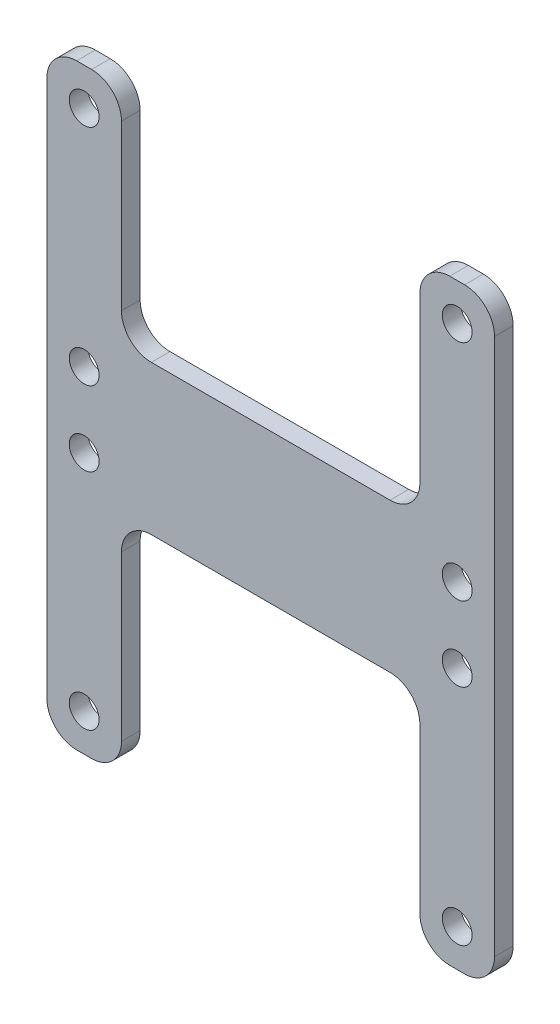
ISO-10303-21;
HEADER;
FILE_DESCRIPTION(('STEP AP214'),'2;1');
FILE_NAME('part.step','',(''),(''),'','','');
FILE_SCHEMA(('AUTOMOTIVE_DESIGN { 1 0 10303 214 1 1 1 1 }'));
ENDSEC;
DATA;
#1=APPLICATION_CONTEXT('core data for automotive mechanical design processes');
#2=APPLICATION_PROTOCOL_DEFINITION('international standard','automotive_design',2000,#1);
#3=PRODUCT_CONTEXT('',#1,'mechanical');
#4=PRODUCT('Part','Part','',(#3));
#5=PRODUCT_RELATED_PRODUCT_CATEGORY('part','',(#4));
#6=PRODUCT_DEFINITION_FORMATION('','',#4);
#7=PRODUCT_DEFINITION_CONTEXT('part definition',#1,'design');
#8=PRODUCT_DEFINITION('design','',#6,#7);
#9=PRODUCT_DEFINITION_SHAPE('','',#8);
#10=(LENGTH_UNIT() NAMED_UNIT(*) SI_UNIT(.MILLI.,.METRE.));
#11=(NAMED_UNIT(*) PLANE_ANGLE_UNIT() SI_UNIT($,.RADIAN.));
#12=(NAMED_UNIT(*) SI_UNIT($,.STERADIAN.) SOLID_ANGLE_UNIT());
#13=UNCERTAINTY_MEASURE_WITH_UNIT(LENGTH_MEASURE(1.E-05),#10,'distance_accuracy_value','');
#14=(GEOMETRIC_REPRESENTATION_CONTEXT(3) GLOBAL_UNCERTAINTY_ASSIGNED_CONTEXT((#13)) GLOBAL_UNIT_ASSIGNED_CONTEXT((#10,
#11,#12)) REPRESENTATION_CONTEXT('',''));
#15=CARTESIAN_POINT('',(0.,0.,0.));
#16=DIRECTION('',(0.,0.,1.));
#17=DIRECTION('',(1.,0.,0.));
#18=AXIS2_PLACEMENT_3D('',#15,#16,#17);
#19=CARTESIAN_POINT('',(0.,50.8,3.175));
#20=DIRECTION('',(0.,1.,0.));
#21=DIRECTION('',(0.,0.,1.));
#22=AXIS2_PLACEMENT_3D('',#19,#20,#21);
#23=PLANE('',#22);
#24=DIRECTION('',(1.,0.,0.));
#25=VECTOR('',#24,1.);
#26=CARTESIAN_POINT('',(0.,50.8,0.));
#27=LINE('',#26,#25);
#28=CARTESIAN_POINT('',(30.48,50.8,0.));
#29=VERTEX_POINT('',#28);
#30=CARTESIAN_POINT('',(33.02,50.8,0.));
#31=VERTEX_POINT('',#30);
#32=EDGE_CURVE('E400',#29,#31,#27,.T.);
#33=ORIENTED_EDGE('',*,*,#32,.F.);
#34=DIRECTION('',(0.,0.,-1.));
#35=VECTOR('',#34,1.);
#36=CARTESIAN_POINT('',(30.48,50.8,3.175));
#37=LINE('',#36,#35);
#38=CARTESIAN_POINT('',(30.48,50.8,3.175));
#39=VERTEX_POINT('',#38);
#40=EDGE_CURVE('E11',#29,#39,#37,.F.);
#41=ORIENTED_EDGE('',*,*,#40,.T.);
#42=DIRECTION('',(1.,0.,0.));
#43=VECTOR('',#42,1.);
#44=CARTESIAN_POINT('',(0.,50.8,3.175));
#45=LINE('',#44,#43);
#46=CARTESIAN_POINT('',(33.02,50.8,3.175));
#47=VERTEX_POINT('',#46);
#48=EDGE_CURVE('E256',#39,#47,#45,.T.);
#49=ORIENTED_EDGE('',*,*,#48,.T.);
#50=DIRECTION('',(0.,0.,-1.));
#51=VECTOR('',#50,1.);
#52=CARTESIAN_POINT('',(33.02,50.8,3.175));
#53=LINE('',#52,#51);
#54=EDGE_CURVE('E53',#47,#31,#53,.T.);
#55=ORIENTED_EDGE('',*,*,#54,.T.);
#56=EDGE_LOOP('',(#33,#41,#49,#55));
#57=FACE_BOUND('',#56,.T.);
#58=ADVANCED_FACE('F44',(#57),#23,.T.);
#59=CARTESIAN_POINT('',(25.4,0.,3.175));
#60=DIRECTION('',(-1.,0.,0.));
#61=DIRECTION('',(0.,0.,1.));
#62=AXIS2_PLACEMENT_3D('',#59,#60,#61);
#63=PLANE('',#62);
#64=DIRECTION('',(0.,1.,0.));
#65=VECTOR('',#64,1.);
#66=CARTESIAN_POINT('',(25.4,0.,3.175));
#67=LINE('',#66,#65);
#68=CARTESIAN_POINT('',(25.4,17.78,3.175));
#69=VERTEX_POINT('',#68);
#70=CARTESIAN_POINT('',(25.4,45.72,3.175));
#71=VERTEX_POINT('',#70);
#72=EDGE_CURVE('E553',#69,#71,#67,.T.);
#73=ORIENTED_EDGE('',*,*,#72,.T.);
#74=DIRECTION('',(0.,0.,-1.));
#75=VECTOR('',#74,1.);
#76=CARTESIAN_POINT('',(25.4,45.72,3.175));
#77=LINE('',#76,#75);
#78=CARTESIAN_POINT('',(25.4,45.72,0.));
#79=VERTEX_POINT('',#78);
#80=EDGE_CURVE('E390',#71,#79,#77,.T.);
#81=ORIENTED_EDGE('',*,*,#80,.T.);
#82=DIRECTION('',(0.,1.,0.));
#83=VECTOR('',#82,1.);
#84=CARTESIAN_POINT('',(25.4,0.,0.));
#85=LINE('',#84,#83);
#86=CARTESIAN_POINT('',(25.4,17.78,0.));
#87=VERTEX_POINT('',#86);
#88=EDGE_CURVE('E408',#87,#79,#85,.T.);
#89=ORIENTED_EDGE('',*,*,#88,.F.);
#90=DIRECTION('',(0.,0.,-1.));
#91=VECTOR('',#90,1.);
#92=CARTESIAN_POINT('',(25.4,17.78,3.175));
#93=LINE('',#92,#91);
#94=EDGE_CURVE('E273',#87,#69,#93,.F.);
#95=ORIENTED_EDGE('',*,*,#94,.T.);
#96=EDGE_LOOP('',(#73,#81,#89,#95));
#97=FACE_BOUND('',#96,.T.);
#98=ADVANCED_FACE('F503',(#97),#63,.T.);
#99=CARTESIAN_POINT('',(0.,12.7,3.175));
#100=DIRECTION('',(0.,1.,0.));
#101=DIRECTION('',(0.,0.,1.));
#102=AXIS2_PLACEMENT_3D('',#99,#100,#101);
#103=PLANE('',#102);
#104=DIRECTION('',(1.,0.,0.));
#105=VECTOR('',#104,1.);
#106=CARTESIAN_POINT('',(0.,12.7,3.175));
#107=LINE('',#106,#105);
#108=CARTESIAN_POINT('',(-20.32,12.7,3.175));
#109=VERTEX_POINT('',#108);
#110=CARTESIAN_POINT('',(20.32,12.7,3.175));
#111=VERTEX_POINT('',#110);
#112=EDGE_CURVE('E558',#109,#111,#107,.T.);
#113=ORIENTED_EDGE('',*,*,#112,.T.);
#114=DIRECTION('',(0.,0.,-1.));
#115=VECTOR('',#114,1.);
#116=CARTESIAN_POINT('',(20.32,12.7,0.));
#117=LINE('',#116,#115);
#118=CARTESIAN_POINT('',(20.32,12.7,0.));
#119=VERTEX_POINT('',#118);
#120=EDGE_CURVE('E269',#111,#119,#117,.T.);
#121=ORIENTED_EDGE('',*,*,#120,.T.);
#122=DIRECTION('',(1.,0.,0.));
#123=VECTOR('',#122,1.);
#124=CARTESIAN_POINT('',(0.,12.7,0.));
#125=LINE('',#124,#123);
#126=CARTESIAN_POINT('',(-20.32,12.7,0.));
#127=VERTEX_POINT('',#126);
#128=EDGE_CURVE('E413',#127,#119,#125,.T.);
#129=ORIENTED_EDGE('',*,*,#128,.F.);
#130=DIRECTION('',(0.,0.,-1.));
#131=VECTOR('',#130,1.);
#132=CARTESIAN_POINT('',(-20.32,12.7,3.175));
#133=LINE('',#132,#131);
#134=EDGE_CURVE('E266',#127,#109,#133,.F.);
#135=ORIENTED_EDGE('',*,*,#134,.T.);
#136=EDGE_LOOP('',(#113,#121,#129,#135));
#137=FACE_BOUND('',#136,.T.);
#138=ADVANCED_FACE('F508',(#137),#103,.T.);
#139=CARTESIAN_POINT('',(-25.4,0.,3.175));
#140=DIRECTION('',(1.,0.,0.));
#141=DIRECTION('',(0.,1.,0.));
#142=AXIS2_PLACEMENT_3D('',#139,#140,#141);
#143=PLANE('',#142);
#144=DIRECTION('',(0.,-1.,0.));
#145=VECTOR('',#144,1.);
#146=CARTESIAN_POINT('',(-25.4,0.,0.));
#147=LINE('',#146,#145);
#148=CARTESIAN_POINT('',(-25.4,45.72,0.));
#149=VERTEX_POINT('',#148);
#150=CARTESIAN_POINT('',(-25.4,17.78,0.));
#151=VERTEX_POINT('',#150);
#152=EDGE_CURVE('E424',#149,#151,#147,.T.);
#153=ORIENTED_EDGE('',*,*,#152,.F.);
#154=DIRECTION('',(0.,0.,-1.));
#155=VECTOR('',#154,1.);
#156=CARTESIAN_POINT('',(-25.4,45.72,3.175));
#157=LINE('',#156,#155);
#158=CARTESIAN_POINT('',(-25.4,45.72,3.175));
#159=VERTEX_POINT('',#158);
#160=EDGE_CURVE('E387',#149,#159,#157,.F.);
#161=ORIENTED_EDGE('',*,*,#160,.T.);
#162=DIRECTION('',(0.,-1.,0.));
#163=VECTOR('',#162,1.);
#164=CARTESIAN_POINT('',(-25.4,0.,3.175));
#165=LINE('',#164,#163);
#166=CARTESIAN_POINT('',(-25.4,17.78,3.175));
#167=VERTEX_POINT('',#166);
#168=EDGE_CURVE('E563',#159,#167,#165,.T.);
#169=ORIENTED_EDGE('',*,*,#168,.T.);
#170=DIRECTION('',(0.,0.,-1.));
#171=VECTOR('',#170,1.);
#172=CARTESIAN_POINT('',(-25.4,17.78,0.));
#173=LINE('',#172,#171);
#174=EDGE_CURVE('E221',#167,#151,#173,.T.);
#175=ORIENTED_EDGE('',*,*,#174,.T.);
#176=EDGE_LOOP('',(#153,#161,#169,#175));
#177=FACE_BOUND('',#176,.T.);
#178=ADVANCED_FACE('F594',(#177),#143,.T.);
#179=CARTESIAN_POINT('',(0.,50.8,3.175));
#180=DIRECTION('',(0.,1.,0.));
#181=DIRECTION('',(0.,0.,1.));
#182=AXIS2_PLACEMENT_3D('',#179,#180,#181);
#183=PLANE('',#182);
#184=DIRECTION('',(1.,0.,0.));
#185=VECTOR('',#184,1.);
#186=CARTESIAN_POINT('',(0.,50.8,0.));
#187=LINE('',#186,#185);
#188=CARTESIAN_POINT('',(-33.02,50.8,0.));
#189=VERTEX_POINT('',#188);
#190=CARTESIAN_POINT('',(-30.48,50.8,0.));
#191=VERTEX_POINT('',#190);
#192=EDGE_CURVE('E427',#189,#191,#187,.T.);
#193=ORIENTED_EDGE('',*,*,#192,.F.);
#194=DIRECTION('',(0.,0.,-1.));
#195=VECTOR('',#194,1.);
#196=CARTESIAN_POINT('',(-33.02,50.8,3.175));
#197=LINE('',#196,#195);
#198=CARTESIAN_POINT('',(-33.02,50.8,3.175));
#199=VERTEX_POINT('',#198);
#200=EDGE_CURVE('E384',#189,#199,#197,.F.);
#201=ORIENTED_EDGE('',*,*,#200,.T.);
#202=DIRECTION('',(1.,0.,0.));
#203=VECTOR('',#202,1.);
#204=CARTESIAN_POINT('',(0.,50.8,3.175));
#205=LINE('',#204,#203);
#206=CARTESIAN_POINT('',(-30.48,50.8,3.175));
#207=VERTEX_POINT('',#206);
#208=EDGE_CURVE('E570',#199,#207,#205,.T.);
#209=ORIENTED_EDGE('',*,*,#208,.T.);
#210=DIRECTION('',(0.,0.,-1.));
#211=VECTOR('',#210,1.);
#212=CARTESIAN_POINT('',(-30.48,50.8,3.175));
#213=LINE('',#212,#211);
#214=EDGE_CURVE('E380',#207,#191,#213,.T.);
#215=ORIENTED_EDGE('',*,*,#214,.T.);
#216=EDGE_LOOP('',(#193,#201,#209,#215));
#217=FACE_BOUND('',#216,.T.);
#218=ADVANCED_FACE('F587',(#217),#183,.T.);
#219=CARTESIAN_POINT('',(-38.1,0.,3.175));
#220=DIRECTION('',(1.,0.,0.));
#221=DIRECTION('',(0.,1.,0.));
#222=AXIS2_PLACEMENT_3D('',#219,#220,#221);
#223=PLANE('',#222);
#224=DIRECTION('',(0.,-1.,0.));
#225=VECTOR('',#224,1.);
#226=CARTESIAN_POINT('',(-38.1,0.,0.));
#227=LINE('',#226,#225);
#228=CARTESIAN_POINT('',(-38.1,45.72,0.));
#229=VERTEX_POINT('',#228);
#230=CARTESIAN_POINT('',(-38.1,-45.72,0.));
#231=VERTEX_POINT('',#230);
#232=EDGE_CURVE('E431',#229,#231,#227,.T.);
#233=ORIENTED_EDGE('',*,*,#232,.T.);
#234=DIRECTION('',(0.,0.,-1.));
#235=VECTOR('',#234,1.);
#236=CARTESIAN_POINT('',(-38.1,-45.72,3.175));
#237=LINE('',#236,#235);
#238=CARTESIAN_POINT('',(-38.1,-45.72,3.175));
#239=VERTEX_POINT('',#238);
#240=EDGE_CURVE('E377',#231,#239,#237,.F.);
#241=ORIENTED_EDGE('',*,*,#240,.T.);
#242=DIRECTION('',(0.,-1.,0.));
#243=VECTOR('',#242,1.);
#244=CARTESIAN_POINT('',(-38.1,0.,3.175));
#245=LINE('',#244,#243);
#246=CARTESIAN_POINT('',(-38.1,45.72,3.175));
#247=VERTEX_POINT('',#246);
#248=EDGE_CURVE('E455',#247,#239,#245,.T.);
#249=ORIENTED_EDGE('',*,*,#248,.F.);
#250=DIRECTION('',(0.,0.,-1.));
#251=VECTOR('',#250,1.);
#252=CARTESIAN_POINT('',(-38.1,45.72,0.));
#253=LINE('',#252,#251);
#254=EDGE_CURVE('E373',#247,#229,#253,.T.);
#255=ORIENTED_EDGE('',*,*,#254,.T.);
#256=EDGE_LOOP('',(#233,#241,#249,#255));
#257=FACE_BOUND('',#256,.T.);
#258=ADVANCED_FACE('F583',(#257),#223,.F.);
#259=CARTESIAN_POINT('',(0.,-50.8,3.175));
#260=DIRECTION('',(0.,1.,0.));
#261=DIRECTION('',(0.,0.,1.));
#262=AXIS2_PLACEMENT_3D('',#259,#260,#261);
#263=PLANE('',#262);
#264=DIRECTION('',(1.,0.,0.));
#265=VECTOR('',#264,1.);
#266=CARTESIAN_POINT('',(0.,-50.8,0.));
#267=LINE('',#266,#265);
#268=CARTESIAN_POINT('',(-33.02,-50.8,0.));
#269=VERTEX_POINT('',#268);
#270=CARTESIAN_POINT('',(-30.48,-50.8,0.));
#271=VERTEX_POINT('',#270);
#272=EDGE_CURVE('E246',#269,#271,#267,.T.);
#273=ORIENTED_EDGE('',*,*,#272,.T.);
#274=DIRECTION('',(0.,0.,-1.));
#275=VECTOR('',#274,1.);
#276=CARTESIAN_POINT('',(-30.48,-50.8,3.175));
#277=LINE('',#276,#275);
#278=CARTESIAN_POINT('',(-30.48,-50.8,3.175));
#279=VERTEX_POINT('',#278);
#280=EDGE_CURVE('E370',#271,#279,#277,.F.);
#281=ORIENTED_EDGE('',*,*,#280,.T.);
#282=DIRECTION('',(1.,0.,0.));
#283=VECTOR('',#282,1.);
#284=CARTESIAN_POINT('',(0.,-50.8,3.175));
#285=LINE('',#284,#283);
#286=CARTESIAN_POINT('',(-33.02,-50.8,3.175));
#287=VERTEX_POINT('',#286);
#288=EDGE_CURVE('E449',#287,#279,#285,.T.);
#289=ORIENTED_EDGE('',*,*,#288,.F.);
#290=DIRECTION('',(0.,0.,-1.));
#291=VECTOR('',#290,1.);
#292=CARTESIAN_POINT('',(-33.02,-50.8,3.175));
#293=LINE('',#292,#291);
#294=EDGE_CURVE('E366',#287,#269,#293,.T.);
#295=ORIENTED_EDGE('',*,*,#294,.T.);
#296=EDGE_LOOP('',(#273,#281,#289,#295));
#297=FACE_BOUND('',#296,.T.);
#298=ADVANCED_FACE('F439',(#297),#263,.F.);
#299=CARTESIAN_POINT('',(-25.4,0.,3.175));
#300=DIRECTION('',(-1.,0.,0.));
#301=DIRECTION('',(0.,0.,1.));
#302=AXIS2_PLACEMENT_3D('',#299,#300,#301);
#303=PLANE('',#302);
#304=DIRECTION('',(0.,1.,0.));
#305=VECTOR('',#304,1.);
#306=CARTESIAN_POINT('',(-25.4,0.,3.175));
#307=LINE('',#306,#305);
#308=CARTESIAN_POINT('',(-25.4,-45.72,3.175));
#309=VERTEX_POINT('',#308);
#310=CARTESIAN_POINT('',(-25.4,-17.7800000000001,3.175));
#311=VERTEX_POINT('',#310);
#312=EDGE_CURVE('E447',#309,#311,#307,.T.);
#313=ORIENTED_EDGE('',*,*,#312,.F.);
#314=DIRECTION('',(0.,0.,-1.));
#315=VECTOR('',#314,1.);
#316=CARTESIAN_POINT('',(-25.4,-45.72,3.175));
#317=LINE('',#316,#315);
#318=CARTESIAN_POINT('',(-25.4,-45.72,0.));
#319=VERTEX_POINT('',#318);
#320=EDGE_CURVE('E362',#309,#319,#317,.T.);
#321=ORIENTED_EDGE('',*,*,#320,.T.);
#322=DIRECTION('',(0.,1.,0.));
#323=VECTOR('',#322,1.);
#324=CARTESIAN_POINT('',(-25.4,0.,0.));
#325=LINE('',#324,#323);
#326=CARTESIAN_POINT('',(-25.4,-17.7800000000001,0.));
#327=VERTEX_POINT('',#326);
#328=EDGE_CURVE('E240',#319,#327,#325,.T.);
#329=ORIENTED_EDGE('',*,*,#328,.T.);
#330=DIRECTION('',(0.,0.,-1.));
#331=VECTOR('',#330,1.);
#332=CARTESIAN_POINT('',(-25.4,-17.7800000000001,3.175));
#333=LINE('',#332,#331);
#334=EDGE_CURVE('E215',#327,#311,#333,.F.);
#335=ORIENTED_EDGE('',*,*,#334,.T.);
#336=EDGE_LOOP('',(#313,#321,#329,#335));
#337=FACE_BOUND('',#336,.T.);
#338=ADVANCED_FACE('F446',(#337),#303,.F.);
#339=CARTESIAN_POINT('',(0.,-12.7000000000001,3.175));
#340=DIRECTION('',(0.,1.,0.));
#341=DIRECTION('',(0.,0.,1.));
#342=AXIS2_PLACEMENT_3D('',#339,#340,#341);
#343=PLANE('',#342);
#344=DIRECTION('',(1.,0.,0.));
#345=VECTOR('',#344,1.);
#346=CARTESIAN_POINT('',(0.,-12.7000000000001,3.175));
#347=LINE('',#346,#345);
#348=CARTESIAN_POINT('',(-20.32,-12.7000000000001,3.175));
#349=VERTEX_POINT('',#348);
#350=CARTESIAN_POINT('',(20.32,-12.7000000000001,3.175));
#351=VERTEX_POINT('',#350);
#352=EDGE_CURVE('E230',#349,#351,#347,.T.);
#353=ORIENTED_EDGE('',*,*,#352,.F.);
#354=DIRECTION('',(0.,0.,-1.));
#355=VECTOR('',#354,1.);
#356=CARTESIAN_POINT('',(-20.32,-12.7000000000001,0.));
#357=LINE('',#356,#355);
#358=CARTESIAN_POINT('',(-20.32,-12.7000000000001,0.));
#359=VERTEX_POINT('',#358);
#360=EDGE_CURVE('E213',#349,#359,#357,.T.);
#361=ORIENTED_EDGE('',*,*,#360,.T.);
#362=DIRECTION('',(1.,0.,0.));
#363=VECTOR('',#362,1.);
#364=CARTESIAN_POINT('',(0.,-12.7000000000001,0.));
#365=LINE('',#364,#363);
#366=CARTESIAN_POINT('',(20.32,-12.7000000000001,0.));
#367=VERTEX_POINT('',#366);
#368=EDGE_CURVE('E227',#359,#367,#365,.T.);
#369=ORIENTED_EDGE('',*,*,#368,.T.);
#370=DIRECTION('',(0.,0.,-1.));
#371=VECTOR('',#370,1.);
#372=CARTESIAN_POINT('',(20.32,-12.7000000000001,3.175));
#373=LINE('',#372,#371);
#374=EDGE_CURVE('E232',#367,#351,#373,.F.);
#375=ORIENTED_EDGE('',*,*,#374,.T.);
#376=EDGE_LOOP('',(#353,#361,#369,#375));
#377=FACE_BOUND('',#376,.T.);
#378=ADVANCED_FACE('F226',(#377),#343,.F.);
#379=CARTESIAN_POINT('',(25.4,0.,3.175));
#380=DIRECTION('',(1.,0.,0.));
#381=DIRECTION('',(0.,1.,0.));
#382=AXIS2_PLACEMENT_3D('',#379,#380,#381);
#383=PLANE('',#382);
#384=DIRECTION('',(0.,-1.,0.));
#385=VECTOR('',#384,1.);
#386=CARTESIAN_POINT('',(25.4,0.,0.));
#387=LINE('',#386,#385);
#388=CARTESIAN_POINT('',(25.4,-17.7800000000001,0.));
#389=VERTEX_POINT('',#388);
#390=CARTESIAN_POINT('',(25.4,-45.72,0.));
#391=VERTEX_POINT('',#390);
#392=EDGE_CURVE('E239',#389,#391,#387,.T.);
#393=ORIENTED_EDGE('',*,*,#392,.T.);
#394=DIRECTION('',(0.,0.,-1.));
#395=VECTOR('',#394,1.);
#396=CARTESIAN_POINT('',(25.4,-45.72,3.175));
#397=LINE('',#396,#395);
#398=CARTESIAN_POINT('',(25.4,-45.72,3.175));
#399=VERTEX_POINT('',#398);
#400=EDGE_CURVE('E60',#391,#399,#397,.F.);
#401=ORIENTED_EDGE('',*,*,#400,.T.);
#402=DIRECTION('',(0.,-1.,0.));
#403=VECTOR('',#402,1.);
#404=CARTESIAN_POINT('',(25.4,0.,3.175));
#405=LINE('',#404,#403);
#406=CARTESIAN_POINT('',(25.4,-17.7800000000001,3.175));
#407=VERTEX_POINT('',#406);
#408=EDGE_CURVE('E453',#407,#399,#405,.T.);
#409=ORIENTED_EDGE('',*,*,#408,.F.);
#410=DIRECTION('',(0.,0.,-1.));
#411=VECTOR('',#410,1.);
#412=CARTESIAN_POINT('',(25.4,-17.7800000000001,0.));
#413=LINE('',#412,#411);
#414=EDGE_CURVE('E262',#407,#389,#413,.T.);
#415=ORIENTED_EDGE('',*,*,#414,.T.);
#416=EDGE_LOOP('',(#393,#401,#409,#415));
#417=FACE_BOUND('',#416,.T.);
#418=ADVANCED_FACE('F482',(#417),#383,.F.);
#419=CARTESIAN_POINT('',(0.,-50.8,3.175));
#420=DIRECTION('',(0.,1.,0.));
#421=DIRECTION('',(0.,0.,1.));
#422=AXIS2_PLACEMENT_3D('',#419,#420,#421);
#423=PLANE('',#422);
#424=DIRECTION('',(1.,0.,0.));
#425=VECTOR('',#424,1.);
#426=CARTESIAN_POINT('',(0.,-50.8,0.));
#427=LINE('',#426,#425);
#428=CARTESIAN_POINT('',(30.48,-50.8,0.));
#429=VERTEX_POINT('',#428);
#430=CARTESIAN_POINT('',(33.02,-50.8,0.));
#431=VERTEX_POINT('',#430);
#432=EDGE_CURVE('E244',#429,#431,#427,.T.);
#433=ORIENTED_EDGE('',*,*,#432,.T.);
#434=DIRECTION('',(0.,0.,-1.));
#435=VECTOR('',#434,1.);
#436=CARTESIAN_POINT('',(33.02,-50.8,3.175));
#437=LINE('',#436,#435);
#438=CARTESIAN_POINT('',(33.02,-50.8,3.175));
#439=VERTEX_POINT('',#438);
#440=EDGE_CURVE('E334',#431,#439,#437,.F.);
#441=ORIENTED_EDGE('',*,*,#440,.T.);
#442=DIRECTION('',(1.,0.,0.));
#443=VECTOR('',#442,1.);
#444=CARTESIAN_POINT('',(0.,-50.8,3.175));
#445=LINE('',#444,#443);
#446=CARTESIAN_POINT('',(30.48,-50.8,3.175));
#447=VERTEX_POINT('',#446);
#448=EDGE_CURVE('E460',#447,#439,#445,.T.);
#449=ORIENTED_EDGE('',*,*,#448,.F.);
#450=DIRECTION('',(0.,0.,-1.));
#451=VECTOR('',#450,1.);
#452=CARTESIAN_POINT('',(30.48,-50.8,3.175));
#453=LINE('',#452,#451);
#454=EDGE_CURVE('E330',#447,#429,#453,.T.);
#455=ORIENTED_EDGE('',*,*,#454,.T.);
#456=EDGE_LOOP('',(#433,#441,#449,#455));
#457=FACE_BOUND('',#456,.T.);
#458=ADVANCED_FACE('F477',(#457),#423,.F.);
#459=CARTESIAN_POINT('',(38.1,0.,3.175));
#460=DIRECTION('',(1.,0.,0.));
#461=DIRECTION('',(0.,1.,0.));
#462=AXIS2_PLACEMENT_3D('',#459,#460,#461);
#463=PLANE('',#462);
#464=DIRECTION('',(0.,-1.,0.));
#465=VECTOR('',#464,1.);
#466=CARTESIAN_POINT('',(38.1,0.,3.175));
#467=LINE('',#466,#465);
#468=CARTESIAN_POINT('',(38.1,45.72,3.175));
#469=VERTEX_POINT('',#468);
#470=CARTESIAN_POINT('',(38.1,-45.72,3.175));
#471=VERTEX_POINT('',#470);
#472=EDGE_CURVE('E258',#469,#471,#467,.T.);
#473=ORIENTED_EDGE('',*,*,#472,.T.);
#474=DIRECTION('',(0.,0.,-1.));
#475=VECTOR('',#474,1.);
#476=CARTESIAN_POINT('',(38.1,-45.72,0.));
#477=LINE('',#476,#475);
#478=CARTESIAN_POINT('',(38.1,-45.72,0.));
#479=VERTEX_POINT('',#478);
#480=EDGE_CURVE('E302',#471,#479,#477,.T.);
#481=ORIENTED_EDGE('',*,*,#480,.T.);
#482=DIRECTION('',(0.,-1.,0.));
#483=VECTOR('',#482,1.);
#484=CARTESIAN_POINT('',(38.1,0.,0.));
#485=LINE('',#484,#483);
#486=CARTESIAN_POINT('',(38.1,45.72,0.));
#487=VERTEX_POINT('',#486);
#488=EDGE_CURVE('E253',#487,#479,#485,.T.);
#489=ORIENTED_EDGE('',*,*,#488,.F.);
#490=DIRECTION('',(0.,0.,-1.));
#491=VECTOR('',#490,1.);
#492=CARTESIAN_POINT('',(38.1,45.72,3.175));
#493=LINE('',#492,#491);
#494=EDGE_CURVE('E299',#487,#469,#493,.F.);
#495=ORIENTED_EDGE('',*,*,#494,.T.);
#496=EDGE_LOOP('',(#473,#481,#489,#495));
#497=FACE_BOUND('',#496,.T.);
#498=ADVANCED_FACE('F470',(#497),#463,.T.);
#499=CARTESIAN_POINT('',(0.,0.,3.175));
#500=DIRECTION('',(0.,0.,1.));
#501=DIRECTION('',(1.,0.,0.));
#502=AXIS2_PLACEMENT_3D('',#499,#500,#501);
#503=PLANE('',#502);
#504=CARTESIAN_POINT('',(-31.75,-6.35000000000004,3.175));
#505=DIRECTION('',(0.,0.,1.));
#506=DIRECTION('',(-1.,0.,0.));
#507=AXIS2_PLACEMENT_3D('',#504,#505,#506);
#508=CIRCLE('',#507,2.54);
#509=CARTESIAN_POINT('',(-34.29,-6.35000000000004,3.175));
#510=VERTEX_POINT('',#509);
#511=EDGE_CURVE('E949',#510,#510,#508,.T.);
#512=ORIENTED_EDGE('',*,*,#511,.F.);
#513=EDGE_LOOP('',(#512));
#514=FACE_BOUND('',#513,.T.);
#515=CARTESIAN_POINT('',(31.75,44.45,3.175));
#516=DIRECTION('',(0.,0.,1.));
#517=DIRECTION('',(1.,0.,0.));
#518=AXIS2_PLACEMENT_3D('',#515,#516,#517);
#519=CIRCLE('',#518,2.54);
#520=CARTESIAN_POINT('',(34.29,44.45,3.175));
#521=VERTEX_POINT('',#520);
#522=EDGE_CURVE('E938',#521,#521,#519,.T.);
#523=ORIENTED_EDGE('',*,*,#522,.F.);
#524=EDGE_LOOP('',(#523));
#525=FACE_BOUND('',#524,.T.);
#526=CARTESIAN_POINT('',(31.75,6.34999999999999,3.175));
#527=DIRECTION('',(0.,0.,1.));
#528=DIRECTION('',(1.,0.,0.));
#529=AXIS2_PLACEMENT_3D('',#526,#527,#528);
#530=CIRCLE('',#529,2.54);
#531=CARTESIAN_POINT('',(34.29,6.34999999999999,3.175));
#532=VERTEX_POINT('',#531);
#533=EDGE_CURVE('E937',#532,#532,#530,.T.);
#534=ORIENTED_EDGE('',*,*,#533,.F.);
#535=EDGE_LOOP('',(#534));
#536=FACE_BOUND('',#535,.T.);
#537=CARTESIAN_POINT('',(-31.75,6.34999999999999,3.175));
#538=DIRECTION('',(0.,0.,1.));
#539=DIRECTION('',(1.,0.,0.));
#540=AXIS2_PLACEMENT_3D('',#537,#538,#539);
#541=CIRCLE('',#540,2.54);
#542=CARTESIAN_POINT('',(-29.21,6.34999999999999,3.175));
#543=VERTEX_POINT('',#542);
#544=EDGE_CURVE('E927',#543,#543,#541,.T.);
#545=ORIENTED_EDGE('',*,*,#544,.F.);
#546=EDGE_LOOP('',(#545));
#547=FACE_BOUND('',#546,.T.);
#548=CARTESIAN_POINT('',(31.7499999999999,-6.35000000000004,3.175));
#549=DIRECTION('',(0.,0.,1.));
#550=DIRECTION('',(-1.,0.,0.));
#551=AXIS2_PLACEMENT_3D('',#548,#549,#550);
#552=CIRCLE('',#551,2.54);
#553=CARTESIAN_POINT('',(29.2099999999999,-6.35000000000004,3.175));
#554=VERTEX_POINT('',#553);
#555=EDGE_CURVE('E950',#554,#554,#552,.T.);
#556=ORIENTED_EDGE('',*,*,#555,.F.);
#557=EDGE_LOOP('',(#556));
#558=FACE_BOUND('',#557,.T.);
#559=CARTESIAN_POINT('',(31.7499999999999,-44.45,3.175));
#560=DIRECTION('',(0.,0.,1.));
#561=DIRECTION('',(-1.,0.,0.));
#562=AXIS2_PLACEMENT_3D('',#559,#560,#561);
#563=CIRCLE('',#562,2.54);
#564=CARTESIAN_POINT('',(29.2099999999999,-44.45,3.175));
#565=VERTEX_POINT('',#564);
#566=EDGE_CURVE('E973',#565,#565,#563,.T.);
#567=ORIENTED_EDGE('',*,*,#566,.F.);
#568=EDGE_LOOP('',(#567));
#569=FACE_BOUND('',#568,.T.);
#570=CARTESIAN_POINT('',(-31.75,-44.45,3.175));
#571=DIRECTION('',(0.,0.,1.));
#572=DIRECTION('',(-1.,0.,0.));
#573=AXIS2_PLACEMENT_3D('',#570,#571,#572);
#574=CIRCLE('',#573,2.54);
#575=CARTESIAN_POINT('',(-34.29,-44.45,3.175));
#576=VERTEX_POINT('',#575);
#577=EDGE_CURVE('E965',#576,#576,#574,.T.);
#578=ORIENTED_EDGE('',*,*,#577,.F.);
#579=EDGE_LOOP('',(#578));
#580=FACE_BOUND('',#579,.T.);
#581=CARTESIAN_POINT('',(-31.75,44.45,3.175));
#582=DIRECTION('',(0.,0.,1.));
#583=DIRECTION('',(1.,0.,0.));
#584=AXIS2_PLACEMENT_3D('',#581,#582,#583);
#585=CIRCLE('',#584,2.54);
#586=CARTESIAN_POINT('',(-29.21,44.45,3.175));
#587=VERTEX_POINT('',#586);
#588=EDGE_CURVE('E416',#587,#587,#585,.T.);
#589=ORIENTED_EDGE('',*,*,#588,.F.);
#590=EDGE_LOOP('',(#589));
#591=FACE_BOUND('',#590,.T.);
#592=ORIENTED_EDGE('',*,*,#448,.T.);
#593=CARTESIAN_POINT('',(33.02,-45.72,3.175));
#594=DIRECTION('',(0.,0.,1.));
#595=DIRECTION('',(1.,0.,0.));
#596=AXIS2_PLACEMENT_3D('',#593,#594,#595);
#597=CIRCLE('',#596,5.08);
#598=EDGE_CURVE('E357',#439,#471,#597,.T.);
#599=ORIENTED_EDGE('',*,*,#598,.T.);
#600=ORIENTED_EDGE('',*,*,#472,.F.);
#601=CARTESIAN_POINT('',(33.02,45.72,3.175));
#602=DIRECTION('',(0.,0.,1.));
#603=DIRECTION('',(1.,0.,0.));
#604=AXIS2_PLACEMENT_3D('',#601,#602,#603);
#605=CIRCLE('',#604,5.08);
#606=EDGE_CURVE('E337',#469,#47,#605,.T.);
#607=ORIENTED_EDGE('',*,*,#606,.T.);
#608=ORIENTED_EDGE('',*,*,#48,.F.);
#609=CARTESIAN_POINT('',(30.48,45.72,3.175));
#610=DIRECTION('',(0.,0.,1.));
#611=DIRECTION('',(1.,0.,0.));
#612=AXIS2_PLACEMENT_3D('',#609,#610,#611);
#613=CIRCLE('',#612,5.08);
#614=EDGE_CURVE('E340',#39,#71,#613,.T.);
#615=ORIENTED_EDGE('',*,*,#614,.T.);
#616=ORIENTED_EDGE('',*,*,#72,.F.);
#617=CARTESIAN_POINT('',(20.32,17.78,3.175));
#618=DIRECTION('',(0.,0.,1.));
#619=DIRECTION('',(1.,0.,0.));
#620=AXIS2_PLACEMENT_3D('',#617,#618,#619);
#621=CIRCLE('',#620,5.08);
#622=EDGE_CURVE('E289',#69,#111,#621,.F.);
#623=ORIENTED_EDGE('',*,*,#622,.T.);
#624=ORIENTED_EDGE('',*,*,#112,.F.);
#625=CARTESIAN_POINT('',(-20.32,17.78,3.175));
#626=DIRECTION('',(0.,0.,1.));
#627=DIRECTION('',(1.,0.,0.));
#628=AXIS2_PLACEMENT_3D('',#625,#626,#627);
#629=CIRCLE('',#628,5.08);
#630=EDGE_CURVE('E295',#109,#167,#629,.F.);
#631=ORIENTED_EDGE('',*,*,#630,.T.);
#632=ORIENTED_EDGE('',*,*,#168,.F.);
#633=CARTESIAN_POINT('',(-30.48,45.72,3.175));
#634=DIRECTION('',(0.,0.,1.));
#635=DIRECTION('',(1.,0.,0.));
#636=AXIS2_PLACEMENT_3D('',#633,#634,#635);
#637=CIRCLE('',#636,5.08);
#638=EDGE_CURVE('E343',#159,#207,#637,.T.);
#639=ORIENTED_EDGE('',*,*,#638,.T.);
#640=ORIENTED_EDGE('',*,*,#208,.F.);
#641=CARTESIAN_POINT('',(-33.02,45.72,3.175));
#642=DIRECTION('',(0.,0.,1.));
#643=DIRECTION('',(1.,0.,0.));
#644=AXIS2_PLACEMENT_3D('',#641,#642,#643);
#645=CIRCLE('',#644,5.08);
#646=EDGE_CURVE('E346',#199,#247,#645,.T.);
#647=ORIENTED_EDGE('',*,*,#646,.T.);
#648=ORIENTED_EDGE('',*,*,#248,.T.);
#649=CARTESIAN_POINT('',(-33.02,-45.72,3.175));
#650=DIRECTION('',(0.,0.,1.));
#651=DIRECTION('',(1.,0.,0.));
#652=AXIS2_PLACEMENT_3D('',#649,#650,#651);
#653=CIRCLE('',#652,5.08);
#654=EDGE_CURVE('E349',#239,#287,#653,.T.);
#655=ORIENTED_EDGE('',*,*,#654,.T.);
#656=ORIENTED_EDGE('',*,*,#288,.T.);
#657=CARTESIAN_POINT('',(-30.48,-45.72,3.175));
#658=DIRECTION('',(0.,0.,1.));
#659=DIRECTION('',(1.,0.,0.));
#660=AXIS2_PLACEMENT_3D('',#657,#658,#659);
#661=CIRCLE('',#660,5.08);
#662=EDGE_CURVE('E68',#279,#309,#661,.T.);
#663=ORIENTED_EDGE('',*,*,#662,.T.);
#664=ORIENTED_EDGE('',*,*,#312,.T.);
#665=CARTESIAN_POINT('',(-20.32,-17.7800000000001,3.175));
#666=DIRECTION('',(0.,0.,1.));
#667=DIRECTION('',(1.,0.,0.));
#668=AXIS2_PLACEMENT_3D('',#665,#666,#667);
#669=CIRCLE('',#668,5.08);
#670=EDGE_CURVE('E220',#311,#349,#669,.F.);
#671=ORIENTED_EDGE('',*,*,#670,.T.);
#672=ORIENTED_EDGE('',*,*,#352,.T.);
#673=CARTESIAN_POINT('',(20.32,-17.7800000000001,3.175));
#674=DIRECTION('',(0.,0.,1.));
#675=DIRECTION('',(1.,0.,0.));
#676=AXIS2_PLACEMENT_3D('',#673,#674,#675);
#677=CIRCLE('',#676,5.08);
#678=EDGE_CURVE('E283',#351,#407,#677,.F.);
#679=ORIENTED_EDGE('',*,*,#678,.T.);
#680=ORIENTED_EDGE('',*,*,#408,.T.);
#681=CARTESIAN_POINT('',(30.48,-45.72,3.175));
#682=DIRECTION('',(0.,0.,1.));
#683=DIRECTION('',(1.,0.,0.));
#684=AXIS2_PLACEMENT_3D('',#681,#682,#683);
#685=CIRCLE('',#684,5.08);
#686=EDGE_CURVE('E354',#399,#447,#685,.T.);
#687=ORIENTED_EDGE('',*,*,#686,.T.);
#688=EDGE_LOOP('',(#592,#599,#600,#607,#608,#615,#616,#623,#624,#631,#632,#639,#640,#647,#648,
#655,#656,#663,#664,#671,#672,#679,#680,#687));
#689=FACE_BOUND('',#688,.T.);
#690=ADVANCED_FACE('F487',(#514,#525,#536,#547,#558,#569,#580,#591,#689),#503,.T.);
#691=CARTESIAN_POINT('',(0.,0.,0.));
#692=DIRECTION('',(0.,0.,1.));
#693=DIRECTION('',(1.,0.,0.));
#694=AXIS2_PLACEMENT_3D('',#691,#692,#693);
#695=PLANE('',#694);
#696=CARTESIAN_POINT('',(-31.75,-6.35000000000004,0.));
#697=DIRECTION('',(0.,0.,1.));
#698=DIRECTION('',(-1.,0.,0.));
#699=AXIS2_PLACEMENT_3D('',#696,#697,#698);
#700=CIRCLE('',#699,2.54);
#701=CARTESIAN_POINT('',(-34.29,-6.35000000000004,0.));
#702=VERTEX_POINT('',#701);
#703=EDGE_CURVE('E945',#702,#702,#700,.T.);
#704=ORIENTED_EDGE('',*,*,#703,.T.);
#705=EDGE_LOOP('',(#704));
#706=FACE_BOUND('',#705,.T.);
#707=CARTESIAN_POINT('',(31.75,44.45,0.));
#708=DIRECTION('',(0.,0.,1.));
#709=DIRECTION('',(1.,0.,0.));
#710=AXIS2_PLACEMENT_3D('',#707,#708,#709);
#711=CIRCLE('',#710,2.54);
#712=CARTESIAN_POINT('',(34.29,44.45,0.));
#713=VERTEX_POINT('',#712);
#714=EDGE_CURVE('E954',#713,#713,#711,.T.);
#715=ORIENTED_EDGE('',*,*,#714,.T.);
#716=EDGE_LOOP('',(#715));
#717=FACE_BOUND('',#716,.T.);
#718=CARTESIAN_POINT('',(31.75,6.34999999999999,0.));
#719=DIRECTION('',(0.,0.,1.));
#720=DIRECTION('',(1.,0.,0.));
#721=AXIS2_PLACEMENT_3D('',#718,#719,#720);
#722=CIRCLE('',#721,2.54);
#723=CARTESIAN_POINT('',(34.29,6.34999999999999,0.));
#724=VERTEX_POINT('',#723);
#725=EDGE_CURVE('E933',#724,#724,#722,.T.);
#726=ORIENTED_EDGE('',*,*,#725,.T.);
#727=EDGE_LOOP('',(#726));
#728=FACE_BOUND('',#727,.T.);
#729=CARTESIAN_POINT('',(-31.75,6.34999999999999,0.));
#730=DIRECTION('',(0.,0.,1.));
#731=DIRECTION('',(1.,0.,0.));
#732=AXIS2_PLACEMENT_3D('',#729,#730,#731);
#733=CIRCLE('',#732,2.54);
#734=CARTESIAN_POINT('',(-29.21,6.34999999999999,0.));
#735=VERTEX_POINT('',#734);
#736=EDGE_CURVE('E930',#735,#735,#733,.T.);
#737=ORIENTED_EDGE('',*,*,#736,.T.);
#738=EDGE_LOOP('',(#737));
#739=FACE_BOUND('',#738,.T.);
#740=CARTESIAN_POINT('',(31.7499999999999,-6.35000000000004,0.));
#741=DIRECTION('',(0.,0.,1.));
#742=DIRECTION('',(-1.,0.,0.));
#743=AXIS2_PLACEMENT_3D('',#740,#741,#742);
#744=CIRCLE('',#743,2.54);
#745=CARTESIAN_POINT('',(29.2099999999999,-6.35000000000004,0.));
#746=VERTEX_POINT('',#745);
#747=EDGE_CURVE('E977',#746,#746,#744,.T.);
#748=ORIENTED_EDGE('',*,*,#747,.T.);
#749=EDGE_LOOP('',(#748));
#750=FACE_BOUND('',#749,.T.);
#751=CARTESIAN_POINT('',(31.7499999999999,-44.45,0.));
#752=DIRECTION('',(0.,0.,1.));
#753=DIRECTION('',(-1.,0.,0.));
#754=AXIS2_PLACEMENT_3D('',#751,#752,#753);
#755=CIRCLE('',#754,2.54);
#756=CARTESIAN_POINT('',(29.2099999999999,-44.45,0.));
#757=VERTEX_POINT('',#756);
#758=EDGE_CURVE('E969',#757,#757,#755,.T.);
#759=ORIENTED_EDGE('',*,*,#758,.T.);
#760=EDGE_LOOP('',(#759));
#761=FACE_BOUND('',#760,.T.);
#762=CARTESIAN_POINT('',(-31.75,-44.45,0.));
#763=DIRECTION('',(0.,0.,1.));
#764=DIRECTION('',(-1.,0.,0.));
#765=AXIS2_PLACEMENT_3D('',#762,#763,#764);
#766=CIRCLE('',#765,2.54);
#767=CARTESIAN_POINT('',(-34.29,-44.45,0.));
#768=VERTEX_POINT('',#767);
#769=EDGE_CURVE('E961',#768,#768,#766,.T.);
#770=ORIENTED_EDGE('',*,*,#769,.T.);
#771=EDGE_LOOP('',(#770));
#772=FACE_BOUND('',#771,.T.);
#773=CARTESIAN_POINT('',(-31.75,44.45,0.));
#774=DIRECTION('',(0.,0.,1.));
#775=DIRECTION('',(1.,0.,0.));
#776=AXIS2_PLACEMENT_3D('',#773,#774,#775);
#777=CIRCLE('',#776,2.54);
#778=CARTESIAN_POINT('',(-29.21,44.45,0.));
#779=VERTEX_POINT('',#778);
#780=EDGE_CURVE('E409',#779,#779,#777,.T.);
#781=ORIENTED_EDGE('',*,*,#780,.T.);
#782=EDGE_LOOP('',(#781));
#783=FACE_BOUND('',#782,.T.);
#784=ORIENTED_EDGE('',*,*,#488,.T.);
#785=CARTESIAN_POINT('',(33.02,-45.72,0.));
#786=DIRECTION('',(0.,0.,1.));
#787=DIRECTION('',(1.,0.,0.));
#788=AXIS2_PLACEMENT_3D('',#785,#786,#787);
#789=CIRCLE('',#788,5.08);
#790=EDGE_CURVE('E327',#479,#431,#789,.F.);
#791=ORIENTED_EDGE('',*,*,#790,.T.);
#792=ORIENTED_EDGE('',*,*,#432,.F.);
#793=CARTESIAN_POINT('',(30.48,-45.72,0.));
#794=DIRECTION('',(0.,0.,1.));
#795=DIRECTION('',(1.,0.,0.));
#796=AXIS2_PLACEMENT_3D('',#793,#794,#795);
#797=CIRCLE('',#796,5.08);
#798=EDGE_CURVE('E324',#429,#391,#797,.F.);
#799=ORIENTED_EDGE('',*,*,#798,.T.);
#800=ORIENTED_EDGE('',*,*,#392,.F.);
#801=CARTESIAN_POINT('',(20.32,-17.7800000000001,0.));
#802=DIRECTION('',(0.,0.,1.));
#803=DIRECTION('',(1.,0.,0.));
#804=AXIS2_PLACEMENT_3D('',#801,#802,#803);
#805=CIRCLE('',#804,5.08);
#806=EDGE_CURVE('E237',#389,#367,#805,.T.);
#807=ORIENTED_EDGE('',*,*,#806,.T.);
#808=ORIENTED_EDGE('',*,*,#368,.F.);
#809=CARTESIAN_POINT('',(-20.32,-17.7800000000001,0.));
#810=DIRECTION('',(0.,0.,1.));
#811=DIRECTION('',(1.,0.,0.));
#812=AXIS2_PLACEMENT_3D('',#809,#810,#811);
#813=CIRCLE('',#812,5.08);
#814=EDGE_CURVE('E209',#359,#327,#813,.T.);
#815=ORIENTED_EDGE('',*,*,#814,.T.);
#816=ORIENTED_EDGE('',*,*,#328,.F.);
#817=CARTESIAN_POINT('',(-30.48,-45.72,0.));
#818=DIRECTION('',(0.,0.,1.));
#819=DIRECTION('',(1.,0.,0.));
#820=AXIS2_PLACEMENT_3D('',#817,#818,#819);
#821=CIRCLE('',#820,5.08);
#822=EDGE_CURVE('E321',#319,#271,#821,.F.);
#823=ORIENTED_EDGE('',*,*,#822,.T.);
#824=ORIENTED_EDGE('',*,*,#272,.F.);
#825=CARTESIAN_POINT('',(-33.02,-45.72,0.));
#826=DIRECTION('',(0.,0.,1.));
#827=DIRECTION('',(1.,0.,0.));
#828=AXIS2_PLACEMENT_3D('',#825,#826,#827);
#829=CIRCLE('',#828,5.08);
#830=EDGE_CURVE('E318',#269,#231,#829,.F.);
#831=ORIENTED_EDGE('',*,*,#830,.T.);
#832=ORIENTED_EDGE('',*,*,#232,.F.);
#833=CARTESIAN_POINT('',(-33.02,45.72,0.));
#834=DIRECTION('',(0.,0.,1.));
#835=DIRECTION('',(1.,0.,0.));
#836=AXIS2_PLACEMENT_3D('',#833,#834,#835);
#837=CIRCLE('',#836,5.08);
#838=EDGE_CURVE('E315',#229,#189,#837,.F.);
#839=ORIENTED_EDGE('',*,*,#838,.T.);
#840=ORIENTED_EDGE('',*,*,#192,.T.);
#841=CARTESIAN_POINT('',(-30.48,45.72,0.));
#842=DIRECTION('',(0.,0.,1.));
#843=DIRECTION('',(1.,0.,0.));
#844=AXIS2_PLACEMENT_3D('',#841,#842,#843);
#845=CIRCLE('',#844,5.08);
#846=EDGE_CURVE('E312',#191,#149,#845,.F.);
#847=ORIENTED_EDGE('',*,*,#846,.T.);
#848=ORIENTED_EDGE('',*,*,#152,.T.);
#849=CARTESIAN_POINT('',(-20.32,17.78,0.));
#850=DIRECTION('',(0.,0.,1.));
#851=DIRECTION('',(1.,0.,0.));
#852=AXIS2_PLACEMENT_3D('',#849,#850,#851);
#853=CIRCLE('',#852,5.08);
#854=EDGE_CURVE('E292',#151,#127,#853,.T.);
#855=ORIENTED_EDGE('',*,*,#854,.T.);
#856=ORIENTED_EDGE('',*,*,#128,.T.);
#857=CARTESIAN_POINT('',(20.32,17.78,0.));
#858=DIRECTION('',(0.,0.,1.));
#859=DIRECTION('',(1.,0.,0.));
#860=AXIS2_PLACEMENT_3D('',#857,#858,#859);
#861=CIRCLE('',#860,5.08);
#862=EDGE_CURVE('E286',#119,#87,#861,.T.);
#863=ORIENTED_EDGE('',*,*,#862,.T.);
#864=ORIENTED_EDGE('',*,*,#88,.T.);
#865=CARTESIAN_POINT('',(30.48,45.72,0.));
#866=DIRECTION('',(0.,0.,1.));
#867=DIRECTION('',(1.,0.,0.));
#868=AXIS2_PLACEMENT_3D('',#865,#866,#867);
#869=CIRCLE('',#868,5.08);
#870=EDGE_CURVE('E309',#79,#29,#869,.F.);
#871=ORIENTED_EDGE('',*,*,#870,.T.);
#872=ORIENTED_EDGE('',*,*,#32,.T.);
#873=CARTESIAN_POINT('',(33.02,45.72,0.));
#874=DIRECTION('',(0.,0.,1.));
#875=DIRECTION('',(1.,0.,0.));
#876=AXIS2_PLACEMENT_3D('',#873,#874,#875);
#877=CIRCLE('',#876,5.08);
#878=EDGE_CURVE('E306',#31,#487,#877,.F.);
#879=ORIENTED_EDGE('',*,*,#878,.T.);
#880=EDGE_LOOP('',(#784,#791,#792,#799,#800,#807,#808,#815,#816,#823,#824,#831,#832,#839,#840,
#847,#848,#855,#856,#863,#864,#871,#872,#879));
#881=FACE_BOUND('',#880,.T.);
#882=ADVANCED_FACE('F235',(#706,#717,#728,#739,#750,#761,#772,#783,#881),#695,.F.);
#883=CARTESIAN_POINT('',(-31.75,44.45,0.));
#884=DIRECTION('',(0.,0.,1.));
#885=DIRECTION('',(1.,0.,0.));
#886=AXIS2_PLACEMENT_3D('',#883,#884,#885);
#887=CYLINDRICAL_SURFACE('',#886,2.54);
#888=ORIENTED_EDGE('',*,*,#780,.F.);
#889=EDGE_LOOP('',(#888));
#890=FACE_BOUND('',#889,.T.);
#891=ORIENTED_EDGE('',*,*,#588,.T.);
#892=EDGE_LOOP('',(#891));
#893=FACE_BOUND('',#892,.T.);
#894=ADVANCED_FACE('F495',(#890,#893),#887,.F.);
#895=CARTESIAN_POINT('',(-31.75,-44.45,0.));
#896=DIRECTION('',(0.,0.,1.));
#897=DIRECTION('',(1.,0.,0.));
#898=AXIS2_PLACEMENT_3D('',#895,#896,#897);
#899=CYLINDRICAL_SURFACE('',#898,2.54);
#900=ORIENTED_EDGE('',*,*,#769,.F.);
#901=EDGE_LOOP('',(#900));
#902=FACE_BOUND('',#901,.T.);
#903=ORIENTED_EDGE('',*,*,#577,.T.);
#904=EDGE_LOOP('',(#903));
#905=FACE_BOUND('',#904,.T.);
#906=ADVANCED_FACE('F790',(#902,#905),#899,.F.);
#907=CARTESIAN_POINT('',(31.7499999999999,-44.45,0.));
#908=DIRECTION('',(0.,0.,1.));
#909=DIRECTION('',(1.,0.,0.));
#910=AXIS2_PLACEMENT_3D('',#907,#908,#909);
#911=CYLINDRICAL_SURFACE('',#910,2.54);
#912=ORIENTED_EDGE('',*,*,#758,.F.);
#913=EDGE_LOOP('',(#912));
#914=FACE_BOUND('',#913,.T.);
#915=ORIENTED_EDGE('',*,*,#566,.T.);
#916=EDGE_LOOP('',(#915));
#917=FACE_BOUND('',#916,.T.);
#918=ADVANCED_FACE('F780',(#914,#917),#911,.F.);
#919=CARTESIAN_POINT('',(31.7499999999999,-6.35000000000004,0.));
#920=DIRECTION('',(0.,0.,1.));
#921=DIRECTION('',(1.,0.,0.));
#922=AXIS2_PLACEMENT_3D('',#919,#920,#921);
#923=CYLINDRICAL_SURFACE('',#922,2.54);
#924=ORIENTED_EDGE('',*,*,#747,.F.);
#925=EDGE_LOOP('',(#924));
#926=FACE_BOUND('',#925,.T.);
#927=ORIENTED_EDGE('',*,*,#555,.T.);
#928=EDGE_LOOP('',(#927));
#929=FACE_BOUND('',#928,.T.);
#930=ADVANCED_FACE('F770',(#926,#929),#923,.F.);
#931=CARTESIAN_POINT('',(-31.75,6.34999999999999,0.));
#932=DIRECTION('',(0.,0.,1.));
#933=DIRECTION('',(1.,0.,0.));
#934=AXIS2_PLACEMENT_3D('',#931,#932,#933);
#935=CYLINDRICAL_SURFACE('',#934,2.54);
#936=ORIENTED_EDGE('',*,*,#736,.F.);
#937=EDGE_LOOP('',(#936));
#938=FACE_BOUND('',#937,.T.);
#939=ORIENTED_EDGE('',*,*,#544,.T.);
#940=EDGE_LOOP('',(#939));
#941=FACE_BOUND('',#940,.T.);
#942=ADVANCED_FACE('F760',(#938,#941),#935,.F.);
#943=CARTESIAN_POINT('',(31.75,6.34999999999999,0.));
#944=DIRECTION('',(0.,0.,1.));
#945=DIRECTION('',(1.,0.,0.));
#946=AXIS2_PLACEMENT_3D('',#943,#944,#945);
#947=CYLINDRICAL_SURFACE('',#946,2.54);
#948=ORIENTED_EDGE('',*,*,#725,.F.);
#949=EDGE_LOOP('',(#948));
#950=FACE_BOUND('',#949,.T.);
#951=ORIENTED_EDGE('',*,*,#533,.T.);
#952=EDGE_LOOP('',(#951));
#953=FACE_BOUND('',#952,.T.);
#954=ADVANCED_FACE('F750',(#950,#953),#947,.F.);
#955=CARTESIAN_POINT('',(31.75,44.45,0.));
#956=DIRECTION('',(0.,0.,1.));
#957=DIRECTION('',(1.,0.,0.));
#958=AXIS2_PLACEMENT_3D('',#955,#956,#957);
#959=CYLINDRICAL_SURFACE('',#958,2.54);
#960=ORIENTED_EDGE('',*,*,#714,.F.);
#961=EDGE_LOOP('',(#960));
#962=FACE_BOUND('',#961,.T.);
#963=ORIENTED_EDGE('',*,*,#522,.T.);
#964=EDGE_LOOP('',(#963));
#965=FACE_BOUND('',#964,.T.);
#966=ADVANCED_FACE('F740',(#962,#965),#959,.F.);
#967=CARTESIAN_POINT('',(-31.75,-6.35000000000004,0.));
#968=DIRECTION('',(0.,0.,1.));
#969=DIRECTION('',(1.,0.,0.));
#970=AXIS2_PLACEMENT_3D('',#967,#968,#969);
#971=CYLINDRICAL_SURFACE('',#970,2.54);
#972=ORIENTED_EDGE('',*,*,#703,.F.);
#973=EDGE_LOOP('',(#972));
#974=FACE_BOUND('',#973,.T.);
#975=ORIENTED_EDGE('',*,*,#511,.T.);
#976=EDGE_LOOP('',(#975));
#977=FACE_BOUND('',#976,.T.);
#978=ADVANCED_FACE('F515',(#974,#977),#971,.F.);
#979=CARTESIAN_POINT('',(-20.32,-17.7800000000001,3.175));
#980=DIRECTION('',(0.,0.,1.));
#981=DIRECTION('',(1.,0.,0.));
#982=AXIS2_PLACEMENT_3D('',#979,#980,#981);
#983=CYLINDRICAL_SURFACE('',#982,5.08);
#984=ORIENTED_EDGE('',*,*,#670,.F.);
#985=ORIENTED_EDGE('',*,*,#334,.F.);
#986=ORIENTED_EDGE('',*,*,#814,.F.);
#987=ORIENTED_EDGE('',*,*,#360,.F.);
#988=EDGE_LOOP('',(#984,#985,#986,#987));
#989=FACE_BOUND('',#988,.T.);
#990=ADVANCED_FACE('F212',(#989),#983,.F.);
#991=CARTESIAN_POINT('',(20.32,-17.7800000000001,3.175));
#992=DIRECTION('',(0.,0.,1.));
#993=DIRECTION('',(1.,0.,0.));
#994=AXIS2_PLACEMENT_3D('',#991,#992,#993);
#995=CYLINDRICAL_SURFACE('',#994,5.08);
#996=ORIENTED_EDGE('',*,*,#678,.F.);
#997=ORIENTED_EDGE('',*,*,#374,.F.);
#998=ORIENTED_EDGE('',*,*,#806,.F.);
#999=ORIENTED_EDGE('',*,*,#414,.F.);
#1000=EDGE_LOOP('',(#996,#997,#998,#999));
#1001=FACE_BOUND('',#1000,.T.);
#1002=ADVANCED_FACE('F486',(#1001),#995,.F.);
#1003=CARTESIAN_POINT('',(20.32,17.78,3.175));
#1004=DIRECTION('',(0.,0.,1.));
#1005=DIRECTION('',(1.,0.,0.));
#1006=AXIS2_PLACEMENT_3D('',#1003,#1004,#1005);
#1007=CYLINDRICAL_SURFACE('',#1006,5.08);
#1008=ORIENTED_EDGE('',*,*,#622,.F.);
#1009=ORIENTED_EDGE('',*,*,#94,.F.);
#1010=ORIENTED_EDGE('',*,*,#862,.F.);
#1011=ORIENTED_EDGE('',*,*,#120,.F.);
#1012=EDGE_LOOP('',(#1008,#1009,#1010,#1011));
#1013=FACE_BOUND('',#1012,.T.);
#1014=ADVANCED_FACE('F518',(#1013),#1007,.F.);
#1015=CARTESIAN_POINT('',(-20.32,17.78,3.175));
#1016=DIRECTION('',(0.,0.,1.));
#1017=DIRECTION('',(1.,0.,0.));
#1018=AXIS2_PLACEMENT_3D('',#1015,#1016,#1017);
#1019=CYLINDRICAL_SURFACE('',#1018,5.08);
#1020=ORIENTED_EDGE('',*,*,#630,.F.);
#1021=ORIENTED_EDGE('',*,*,#134,.F.);
#1022=ORIENTED_EDGE('',*,*,#854,.F.);
#1023=ORIENTED_EDGE('',*,*,#174,.F.);
#1024=EDGE_LOOP('',(#1020,#1021,#1022,#1023));
#1025=FACE_BOUND('',#1024,.T.);
#1026=ADVANCED_FACE('F521',(#1025),#1019,.F.);
#1027=CARTESIAN_POINT('',(33.02,-45.72,3.175));
#1028=DIRECTION('',(0.,0.,1.));
#1029=DIRECTION('',(1.,0.,0.));
#1030=AXIS2_PLACEMENT_3D('',#1027,#1028,#1029);
#1031=CYLINDRICAL_SURFACE('',#1030,5.08);
#1032=ORIENTED_EDGE('',*,*,#598,.F.);
#1033=ORIENTED_EDGE('',*,*,#440,.F.);
#1034=ORIENTED_EDGE('',*,*,#790,.F.);
#1035=ORIENTED_EDGE('',*,*,#480,.F.);
#1036=EDGE_LOOP('',(#1032,#1033,#1034,#1035));
#1037=FACE_BOUND('',#1036,.T.);
#1038=ADVANCED_FACE('F473',(#1037),#1031,.T.);
#1039=CARTESIAN_POINT('',(30.48,-45.72,3.175));
#1040=DIRECTION('',(0.,0.,-1.));
#1041=DIRECTION('',(-1.,0.,0.));
#1042=AXIS2_PLACEMENT_3D('',#1039,#1040,#1041);
#1043=CYLINDRICAL_SURFACE('',#1042,5.08);
#1044=ORIENTED_EDGE('',*,*,#686,.F.);
#1045=ORIENTED_EDGE('',*,*,#400,.F.);
#1046=ORIENTED_EDGE('',*,*,#798,.F.);
#1047=ORIENTED_EDGE('',*,*,#454,.F.);
#1048=EDGE_LOOP('',(#1044,#1045,#1046,#1047));
#1049=FACE_BOUND('',#1048,.T.);
#1050=ADVANCED_FACE('F481',(#1049),#1043,.T.);
#1051=CARTESIAN_POINT('',(-30.48,-45.72,3.175));
#1052=DIRECTION('',(0.,0.,-1.));
#1053=DIRECTION('',(-1.,0.,0.));
#1054=AXIS2_PLACEMENT_3D('',#1051,#1052,#1053);
#1055=CYLINDRICAL_SURFACE('',#1054,5.08);
#1056=ORIENTED_EDGE('',*,*,#662,.F.);
#1057=ORIENTED_EDGE('',*,*,#280,.F.);
#1058=ORIENTED_EDGE('',*,*,#822,.F.);
#1059=ORIENTED_EDGE('',*,*,#320,.F.);
#1060=EDGE_LOOP('',(#1056,#1057,#1058,#1059));
#1061=FACE_BOUND('',#1060,.T.);
#1062=ADVANCED_FACE('F443',(#1061),#1055,.T.);
#1063=CARTESIAN_POINT('',(-33.02,-45.72,3.175));
#1064=DIRECTION('',(0.,0.,-1.));
#1065=DIRECTION('',(-1.,0.,0.));
#1066=AXIS2_PLACEMENT_3D('',#1063,#1064,#1065);
#1067=CYLINDRICAL_SURFACE('',#1066,5.08);
#1068=ORIENTED_EDGE('',*,*,#654,.F.);
#1069=ORIENTED_EDGE('',*,*,#240,.F.);
#1070=ORIENTED_EDGE('',*,*,#830,.F.);
#1071=ORIENTED_EDGE('',*,*,#294,.F.);
#1072=EDGE_LOOP('',(#1068,#1069,#1070,#1071));
#1073=FACE_BOUND('',#1072,.T.);
#1074=ADVANCED_FACE('F532',(#1073),#1067,.T.);
#1075=CARTESIAN_POINT('',(-33.02,45.72,3.175));
#1076=DIRECTION('',(0.,0.,1.));
#1077=DIRECTION('',(1.,0.,0.));
#1078=AXIS2_PLACEMENT_3D('',#1075,#1076,#1077);
#1079=CYLINDRICAL_SURFACE('',#1078,5.08);
#1080=ORIENTED_EDGE('',*,*,#646,.F.);
#1081=ORIENTED_EDGE('',*,*,#200,.F.);
#1082=ORIENTED_EDGE('',*,*,#838,.F.);
#1083=ORIENTED_EDGE('',*,*,#254,.F.);
#1084=EDGE_LOOP('',(#1080,#1081,#1082,#1083));
#1085=FACE_BOUND('',#1084,.T.);
#1086=ADVANCED_FACE('F535',(#1085),#1079,.T.);
#1087=CARTESIAN_POINT('',(-30.48,45.72,3.175));
#1088=DIRECTION('',(0.,0.,-1.));
#1089=DIRECTION('',(-1.,0.,0.));
#1090=AXIS2_PLACEMENT_3D('',#1087,#1088,#1089);
#1091=CYLINDRICAL_SURFACE('',#1090,5.08);
#1092=ORIENTED_EDGE('',*,*,#638,.F.);
#1093=ORIENTED_EDGE('',*,*,#160,.F.);
#1094=ORIENTED_EDGE('',*,*,#846,.F.);
#1095=ORIENTED_EDGE('',*,*,#214,.F.);
#1096=EDGE_LOOP('',(#1092,#1093,#1094,#1095));
#1097=FACE_BOUND('',#1096,.T.);
#1098=ADVANCED_FACE('F539',(#1097),#1091,.T.);
#1099=CARTESIAN_POINT('',(30.48,45.72,3.175));
#1100=DIRECTION('',(0.,0.,-1.));
#1101=DIRECTION('',(-1.,0.,0.));
#1102=AXIS2_PLACEMENT_3D('',#1099,#1100,#1101);
#1103=CYLINDRICAL_SURFACE('',#1102,5.08);
#1104=ORIENTED_EDGE('',*,*,#614,.F.);
#1105=ORIENTED_EDGE('',*,*,#40,.F.);
#1106=ORIENTED_EDGE('',*,*,#870,.F.);
#1107=ORIENTED_EDGE('',*,*,#80,.F.);
#1108=EDGE_LOOP('',(#1104,#1105,#1106,#1107));
#1109=FACE_BOUND('',#1108,.T.);
#1110=ADVANCED_FACE('F542',(#1109),#1103,.T.);
#1111=CARTESIAN_POINT('',(33.02,45.72,3.175));
#1112=DIRECTION('',(0.,0.,-1.));
#1113=DIRECTION('',(-1.,0.,0.));
#1114=AXIS2_PLACEMENT_3D('',#1111,#1112,#1113);
#1115=CYLINDRICAL_SURFACE('',#1114,5.08);
#1116=ORIENTED_EDGE('',*,*,#606,.F.);
#1117=ORIENTED_EDGE('',*,*,#494,.F.);
#1118=ORIENTED_EDGE('',*,*,#878,.F.);
#1119=ORIENTED_EDGE('',*,*,#54,.F.);
#1120=EDGE_LOOP('',(#1116,#1117,#1118,#1119));
#1121=FACE_BOUND('',#1120,.T.);
#1122=ADVANCED_FACE('F46',(#1121),#1115,.T.);
#1123=CLOSED_SHELL('',(#58,#98,#138,#178,#218,#258,#298,#338,#378,#418,#458,#498,#690,#882,#894,
#906,#918,#930,#942,#954,#966,#978,#990,#1002,#1014,#1026,#1038,#1050,#1062,#1074,#1086,#1098,
#1110,#1122));
#1124=MANIFOLD_SOLID_BREP('B2',#1123);
#1125=ADVANCED_BREP_SHAPE_REPRESENTATION('',(#18,#1124),#14);
#1126=SHAPE_DEFINITION_REPRESENTATION(#9,#1125);
ENDSEC;
END-ISO-10303-21;
